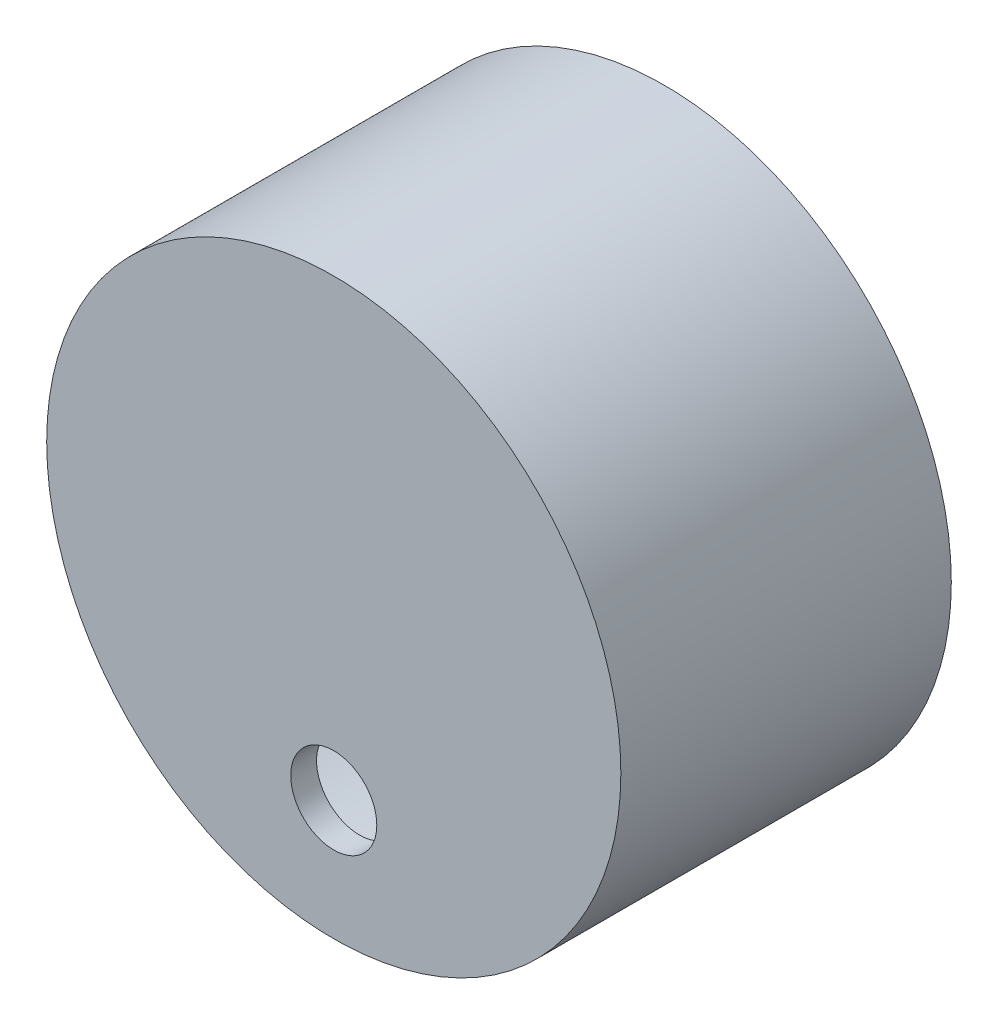
ISO-10303-21;
HEADER;
FILE_DESCRIPTION(('STEP AP214'),'2;1');
FILE_NAME('part.step','',(''),(''),'','','');
FILE_SCHEMA(('AUTOMOTIVE_DESIGN { 1 0 10303 214 1 1 1 1 }'));
ENDSEC;
DATA;
#1=APPLICATION_CONTEXT('core data for automotive mechanical design processes');
#2=APPLICATION_PROTOCOL_DEFINITION('international standard','automotive_design',2000,#1);
#3=PRODUCT_CONTEXT('',#1,'mechanical');
#4=PRODUCT('Part','Part','',(#3));
#5=PRODUCT_RELATED_PRODUCT_CATEGORY('part','',(#4));
#6=PRODUCT_DEFINITION_FORMATION('','',#4);
#7=PRODUCT_DEFINITION_CONTEXT('part definition',#1,'design');
#8=PRODUCT_DEFINITION('design','',#6,#7);
#9=PRODUCT_DEFINITION_SHAPE('','',#8);
#10=(LENGTH_UNIT() NAMED_UNIT(*) SI_UNIT(.MILLI.,.METRE.));
#11=(NAMED_UNIT(*) PLANE_ANGLE_UNIT() SI_UNIT($,.RADIAN.));
#12=(NAMED_UNIT(*) SI_UNIT($,.STERADIAN.) SOLID_ANGLE_UNIT());
#13=UNCERTAINTY_MEASURE_WITH_UNIT(LENGTH_MEASURE(1.E-05),#10,'distance_accuracy_value','');
#14=(GEOMETRIC_REPRESENTATION_CONTEXT(3) GLOBAL_UNCERTAINTY_ASSIGNED_CONTEXT((#13)) GLOBAL_UNIT_ASSIGNED_CONTEXT((#10,
#11,#12)) REPRESENTATION_CONTEXT('',''));
#15=CARTESIAN_POINT('',(0.,0.,0.));
#16=DIRECTION('',(0.,0.,1.));
#17=DIRECTION('',(1.,0.,0.));
#18=AXIS2_PLACEMENT_3D('',#15,#16,#17);
#19=CARTESIAN_POINT('',(22.75,10.5,-104.351665814358));
#20=DIRECTION('',(0.,0.,1.));
#21=DIRECTION('',(1.,0.,0.));
#22=AXIS2_PLACEMENT_3D('',#19,#20,#21);
#23=CYLINDRICAL_SURFACE('',#22,33.3583513567899);
#24=CARTESIAN_POINT('',(22.75,10.5,-9.99999999999999));
#25=DIRECTION('',(0.,0.,-1.));
#26=DIRECTION('',(-1.,0.,0.));
#27=AXIS2_PLACEMENT_3D('',#24,#25,#26);
#28=CIRCLE('',#27,33.3583513567899);
#29=CARTESIAN_POINT('',(-10.6083513567899,10.5,-9.99999999999999));
#30=VERTEX_POINT('',#29);
#31=EDGE_CURVE('E39',#30,#30,#28,.F.);
#32=ORIENTED_EDGE('',*,*,#31,.T.);
#33=EDGE_LOOP('',(#32));
#34=FACE_BOUND('',#33,.T.);
#35=CARTESIAN_POINT('',(22.75,10.5,28.4));
#36=DIRECTION('',(0.,0.,1.));
#37=DIRECTION('',(1.,0.,0.));
#38=AXIS2_PLACEMENT_3D('',#35,#36,#37);
#39=CIRCLE('',#38,33.3583513567899);
#40=CARTESIAN_POINT('',(56.1083513567899,10.5,28.4));
#41=VERTEX_POINT('',#40);
#42=EDGE_CURVE('E50',#41,#41,#39,.T.);
#43=ORIENTED_EDGE('',*,*,#42,.F.);
#44=EDGE_LOOP('',(#43));
#45=FACE_BOUND('',#44,.T.);
#46=ADVANCED_FACE('F35',(#34,#45),#23,.T.);
#47=CARTESIAN_POINT('',(22.75,10.5,-104.351665814358));
#48=DIRECTION('',(0.,0.,1.));
#49=DIRECTION('',(1.,0.,0.));
#50=AXIS2_PLACEMENT_3D('',#47,#48,#49);
#51=CYLINDRICAL_SURFACE('',#50,30.3583513567899);
#52=CARTESIAN_POINT('',(22.75,10.5,-9.99999999999999));
#53=DIRECTION('',(0.,0.,-1.));
#54=DIRECTION('',(-1.,0.,0.));
#55=AXIS2_PLACEMENT_3D('',#52,#53,#54);
#56=CIRCLE('',#55,30.3583513567899);
#57=CARTESIAN_POINT('',(-7.60835135678992,10.5,-9.99999999999999));
#58=VERTEX_POINT('',#57);
#59=EDGE_CURVE('E10',#58,#58,#56,.F.);
#60=ORIENTED_EDGE('',*,*,#59,.F.);
#61=EDGE_LOOP('',(#60));
#62=FACE_BOUND('',#61,.T.);
#63=CARTESIAN_POINT('',(22.75,10.5,25.4));
#64=DIRECTION('',(0.,0.,1.));
#65=DIRECTION('',(1.,0.,0.));
#66=AXIS2_PLACEMENT_3D('',#63,#64,#65);
#67=CIRCLE('',#66,30.3583513567899);
#68=CARTESIAN_POINT('',(53.1083513567899,10.5,25.4));
#69=VERTEX_POINT('',#68);
#70=EDGE_CURVE('E46',#69,#69,#67,.T.);
#71=ORIENTED_EDGE('',*,*,#70,.T.);
#72=EDGE_LOOP('',(#71));
#73=FACE_BOUND('',#72,.T.);
#74=ADVANCED_FACE('F76',(#62,#73),#51,.F.);
#75=CARTESIAN_POINT('',(0.,0.,-10.));
#76=DIRECTION('',(0.,0.,-1.));
#77=DIRECTION('',(-1.,0.,0.));
#78=AXIS2_PLACEMENT_3D('',#75,#76,#77);
#79=PLANE('',#78);
#80=ORIENTED_EDGE('',*,*,#31,.F.);
#81=EDGE_LOOP('',(#80));
#82=FACE_BOUND('',#81,.T.);
#83=ORIENTED_EDGE('',*,*,#59,.T.);
#84=EDGE_LOOP('',(#83));
#85=FACE_BOUND('',#84,.T.);
#86=ADVANCED_FACE('F37',(#82,#85),#79,.T.);
#87=CARTESIAN_POINT('',(22.75,10.5,25.4));
#88=DIRECTION('',(0.,0.,1.));
#89=DIRECTION('',(1.,0.,0.));
#90=AXIS2_PLACEMENT_3D('',#87,#88,#89);
#91=PLANE('',#90);
#92=CARTESIAN_POINT('',(22.75,-8.91361717282976,25.4));
#93=DIRECTION('',(0.,0.,1.));
#94=DIRECTION('',(1.,0.,0.));
#95=AXIS2_PLACEMENT_3D('',#92,#93,#94);
#96=CIRCLE('',#95,5.);
#97=CARTESIAN_POINT('',(27.75,-8.91361717282976,25.4));
#98=VERTEX_POINT('',#97);
#99=EDGE_CURVE('E54',#98,#98,#96,.T.);
#100=ORIENTED_EDGE('',*,*,#99,.T.);
#101=EDGE_LOOP('',(#100));
#102=FACE_BOUND('',#101,.T.);
#103=ORIENTED_EDGE('',*,*,#70,.F.);
#104=EDGE_LOOP('',(#103));
#105=FACE_BOUND('',#104,.T.);
#106=ADVANCED_FACE('F65',(#102,#105),#91,.F.);
#107=CARTESIAN_POINT('',(22.75,10.5,28.4));
#108=DIRECTION('',(0.,0.,1.));
#109=DIRECTION('',(1.,0.,0.));
#110=AXIS2_PLACEMENT_3D('',#107,#108,#109);
#111=PLANE('',#110);
#112=ORIENTED_EDGE('',*,*,#42,.T.);
#113=EDGE_LOOP('',(#112));
#114=FACE_BOUND('',#113,.T.);
#115=CARTESIAN_POINT('',(22.75,-8.91361717282976,28.4));
#116=DIRECTION('',(0.,0.,1.));
#117=DIRECTION('',(1.,0.,0.));
#118=AXIS2_PLACEMENT_3D('',#115,#116,#117);
#119=CIRCLE('',#118,5.);
#120=CARTESIAN_POINT('',(27.75,-8.91361717282976,28.4));
#121=VERTEX_POINT('',#120);
#122=EDGE_CURVE('E53',#121,#121,#119,.T.);
#123=ORIENTED_EDGE('',*,*,#122,.F.);
#124=EDGE_LOOP('',(#123));
#125=FACE_BOUND('',#124,.T.);
#126=ADVANCED_FACE('F63',(#114,#125),#111,.T.);
#127=CARTESIAN_POINT('',(22.75,-8.91361717282976,28.4));
#128=DIRECTION('',(0.,0.,-1.));
#129=DIRECTION('',(-1.,0.,0.));
#130=AXIS2_PLACEMENT_3D('',#127,#128,#129);
#131=CYLINDRICAL_SURFACE('',#130,5.);
#132=ORIENTED_EDGE('',*,*,#122,.T.);
#133=EDGE_LOOP('',(#132));
#134=FACE_BOUND('',#133,.T.);
#135=ORIENTED_EDGE('',*,*,#99,.F.);
#136=EDGE_LOOP('',(#135));
#137=FACE_BOUND('',#136,.T.);
#138=ADVANCED_FACE('F60',(#134,#137),#131,.F.);
#139=CLOSED_SHELL('',(#46,#74,#86,#106,#126,#138));
#140=MANIFOLD_SOLID_BREP('B2',#139);
#141=ADVANCED_BREP_SHAPE_REPRESENTATION('',(#18,#140),#14);
#142=SHAPE_DEFINITION_REPRESENTATION(#9,#141);
ENDSEC;
END-ISO-10303-21;
